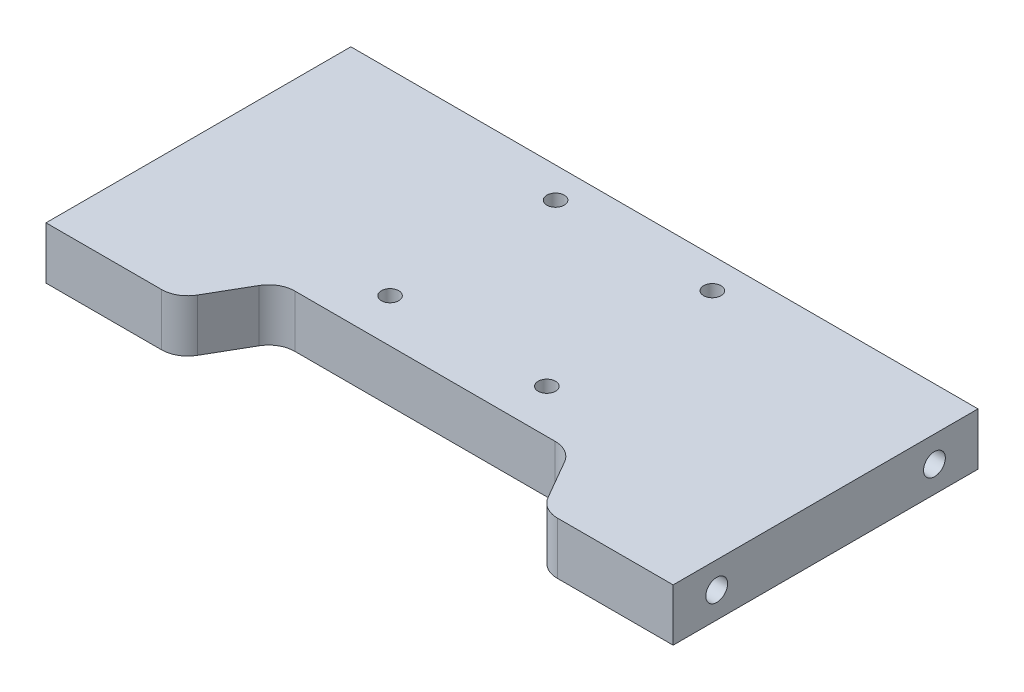
ISO-10303-21;
HEADER;
FILE_DESCRIPTION(('STEP AP214'),'2;1');
FILE_NAME('part.step','',(''),(''),'','','');
FILE_SCHEMA(('AUTOMOTIVE_DESIGN { 1 0 10303 214 1 1 1 1 }'));
ENDSEC;
DATA;
#1=APPLICATION_CONTEXT('core data for automotive mechanical design processes');
#2=APPLICATION_PROTOCOL_DEFINITION('international standard','automotive_design',2000,#1);
#3=PRODUCT_CONTEXT('',#1,'mechanical');
#4=PRODUCT('Part','Part','',(#3));
#5=PRODUCT_RELATED_PRODUCT_CATEGORY('part','',(#4));
#6=PRODUCT_DEFINITION_FORMATION('','',#4);
#7=PRODUCT_DEFINITION_CONTEXT('part definition',#1,'design');
#8=PRODUCT_DEFINITION('design','',#6,#7);
#9=PRODUCT_DEFINITION_SHAPE('','',#8);
#10=(LENGTH_UNIT() NAMED_UNIT(*) SI_UNIT(.MILLI.,.METRE.));
#11=(NAMED_UNIT(*) PLANE_ANGLE_UNIT() SI_UNIT($,.RADIAN.));
#12=(NAMED_UNIT(*) SI_UNIT($,.STERADIAN.) SOLID_ANGLE_UNIT());
#13=UNCERTAINTY_MEASURE_WITH_UNIT(LENGTH_MEASURE(1.E-05),#10,'distance_accuracy_value','');
#14=(GEOMETRIC_REPRESENTATION_CONTEXT(3) GLOBAL_UNCERTAINTY_ASSIGNED_CONTEXT((#13)) GLOBAL_UNIT_ASSIGNED_CONTEXT((#10,
#11,#12)) REPRESENTATION_CONTEXT('',''));
#15=CARTESIAN_POINT('',(0.,0.,0.));
#16=DIRECTION('',(0.,0.,1.));
#17=DIRECTION('',(1.,0.,0.));
#18=AXIS2_PLACEMENT_3D('',#15,#16,#17);
#19=CARTESIAN_POINT('',(0.,6.,0.));
#20=DIRECTION('',(0.,0.,-1.));
#21=DIRECTION('',(-1.,0.,0.));
#22=AXIS2_PLACEMENT_3D('',#19,#20,#21);
#23=PLANE('',#22);
#24=DIRECTION('',(1.,0.,0.));
#25=VECTOR('',#24,1.);
#26=CARTESIAN_POINT('',(0.,0.,0.));
#27=LINE('',#26,#25);
#28=CARTESIAN_POINT('',(0.,0.,0.));
#29=VERTEX_POINT('',#28);
#30=CARTESIAN_POINT('',(13.2679491924311,0.,0.));
#31=VERTEX_POINT('',#30);
#32=EDGE_CURVE('E222',#29,#31,#27,.T.);
#33=ORIENTED_EDGE('',*,*,#32,.T.);
#34=DIRECTION('',(0.,1.,0.));
#35=VECTOR('',#34,1.);
#36=CARTESIAN_POINT('',(13.2679491924311,6.,0.));
#37=LINE('',#36,#35);
#38=CARTESIAN_POINT('',(13.2679491924311,6.,0.));
#39=VERTEX_POINT('',#38);
#40=EDGE_CURVE('E263',#31,#39,#37,.T.);
#41=ORIENTED_EDGE('',*,*,#40,.T.);
#42=DIRECTION('',(1.,0.,0.));
#43=VECTOR('',#42,1.);
#44=CARTESIAN_POINT('',(0.,6.,0.));
#45=LINE('',#44,#43);
#46=CARTESIAN_POINT('',(0.,6.,0.));
#47=VERTEX_POINT('',#46);
#48=EDGE_CURVE('E211',#47,#39,#45,.T.);
#49=ORIENTED_EDGE('',*,*,#48,.F.);
#50=DIRECTION('',(0.,-1.,0.));
#51=VECTOR('',#50,1.);
#52=CARTESIAN_POINT('',(0.,6.,0.));
#53=LINE('',#52,#51);
#54=EDGE_CURVE('E236',#47,#29,#53,.T.);
#55=ORIENTED_EDGE('',*,*,#54,.T.);
#56=EDGE_LOOP('',(#33,#41,#49,#55));
#57=FACE_BOUND('',#56,.T.);
#58=ADVANCED_FACE('F33',(#57),#23,.F.);
#59=CARTESIAN_POINT('',(0.,6.,0.));
#60=DIRECTION('',(1.,0.,0.));
#61=DIRECTION('',(0.,0.,-1.));
#62=AXIS2_PLACEMENT_3D('',#59,#60,#61);
#63=PLANE('',#62);
#64=CARTESIAN_POINT('',(0.,3.,-30.));
#65=DIRECTION('',(-1.,0.,0.));
#66=DIRECTION('',(0.,0.,1.));
#67=AXIS2_PLACEMENT_3D('',#64,#65,#66);
#68=CIRCLE('',#67,1.25);
#69=CARTESIAN_POINT('',(0.,3.,-28.75));
#70=VERTEX_POINT('',#69);
#71=EDGE_CURVE('E154',#70,#70,#68,.T.);
#72=ORIENTED_EDGE('',*,*,#71,.F.);
#73=EDGE_LOOP('',(#72));
#74=FACE_BOUND('',#73,.T.);
#75=CARTESIAN_POINT('',(0.,3.,-5.));
#76=DIRECTION('',(-1.,0.,0.));
#77=DIRECTION('',(0.,0.,1.));
#78=AXIS2_PLACEMENT_3D('',#75,#76,#77);
#79=CIRCLE('',#78,1.25);
#80=CARTESIAN_POINT('',(0.,3.,-3.75));
#81=VERTEX_POINT('',#80);
#82=EDGE_CURVE('E160',#81,#81,#79,.T.);
#83=ORIENTED_EDGE('',*,*,#82,.F.);
#84=EDGE_LOOP('',(#83));
#85=FACE_BOUND('',#84,.T.);
#86=DIRECTION('',(0.,0.,1.));
#87=VECTOR('',#86,1.);
#88=CARTESIAN_POINT('',(0.,0.,0.));
#89=LINE('',#88,#87);
#90=CARTESIAN_POINT('',(0.,0.,-35.));
#91=VERTEX_POINT('',#90);
#92=EDGE_CURVE('E205',#91,#29,#89,.T.);
#93=ORIENTED_EDGE('',*,*,#92,.T.);
#94=ORIENTED_EDGE('',*,*,#54,.F.);
#95=DIRECTION('',(0.,0.,1.));
#96=VECTOR('',#95,1.);
#97=CARTESIAN_POINT('',(0.,6.,0.));
#98=LINE('',#97,#96);
#99=CARTESIAN_POINT('',(0.,6.,-35.));
#100=VERTEX_POINT('',#99);
#101=EDGE_CURVE('E206',#100,#47,#98,.T.);
#102=ORIENTED_EDGE('',*,*,#101,.F.);
#103=DIRECTION('',(0.,-1.,0.));
#104=VECTOR('',#103,1.);
#105=CARTESIAN_POINT('',(0.,6.,-35.));
#106=LINE('',#105,#104);
#107=EDGE_CURVE('E218',#100,#91,#106,.T.);
#108=ORIENTED_EDGE('',*,*,#107,.T.);
#109=EDGE_LOOP('',(#93,#94,#102,#108));
#110=FACE_BOUND('',#109,.T.);
#111=ADVANCED_FACE('F293',(#74,#85,#110),#63,.F.);
#112=CARTESIAN_POINT('',(58.7320508075689,6.,0.));
#113=VERTEX_POINT('',#112);
#114=CARTESIAN_POINT('',(72.,6.,0.));
#115=VERTEX_POINT('',#114);
#116=EDGE_CURVE('E209',#113,#115,#45,.T.);
#117=ORIENTED_EDGE('',*,*,#116,.F.);
#118=DIRECTION('',(0.,1.,0.));
#119=VECTOR('',#118,1.);
#120=CARTESIAN_POINT('',(58.7320508075689,6.,0.));
#121=LINE('',#120,#119);
#122=CARTESIAN_POINT('',(58.7320508075689,0.,0.));
#123=VERTEX_POINT('',#122);
#124=EDGE_CURVE('E248',#113,#123,#121,.F.);
#125=ORIENTED_EDGE('',*,*,#124,.T.);
#126=CARTESIAN_POINT('',(72.,0.,0.));
#127=VERTEX_POINT('',#126);
#128=EDGE_CURVE('E221',#123,#127,#27,.T.);
#129=ORIENTED_EDGE('',*,*,#128,.T.);
#130=DIRECTION('',(0.,-1.,0.));
#131=VECTOR('',#130,1.);
#132=CARTESIAN_POINT('',(72.,6.,0.));
#133=LINE('',#132,#131);
#134=EDGE_CURVE('E233',#115,#127,#133,.T.);
#135=ORIENTED_EDGE('',*,*,#134,.F.);
#136=EDGE_LOOP('',(#117,#125,#129,#135));
#137=FACE_BOUND('',#136,.T.);
#138=ADVANCED_FACE('F307',(#137),#23,.F.);
#139=CARTESIAN_POINT('',(72.,6.,0.));
#140=DIRECTION('',(-1.,0.,0.));
#141=DIRECTION('',(0.,0.,1.));
#142=AXIS2_PLACEMENT_3D('',#139,#140,#141);
#143=PLANE('',#142);
#144=CARTESIAN_POINT('',(72.,3.,-5.));
#145=DIRECTION('',(1.,0.,0.));
#146=DIRECTION('',(0.,0.,-1.));
#147=AXIS2_PLACEMENT_3D('',#144,#145,#146);
#148=CIRCLE('',#147,1.25);
#149=CARTESIAN_POINT('',(72.,3.,-6.25));
#150=VERTEX_POINT('',#149);
#151=EDGE_CURVE('E144',#150,#150,#148,.T.);
#152=ORIENTED_EDGE('',*,*,#151,.F.);
#153=EDGE_LOOP('',(#152));
#154=FACE_BOUND('',#153,.T.);
#155=CARTESIAN_POINT('',(72.,3.,-30.));
#156=DIRECTION('',(1.,0.,0.));
#157=DIRECTION('',(0.,0.,-1.));
#158=AXIS2_PLACEMENT_3D('',#155,#156,#157);
#159=CIRCLE('',#158,1.25);
#160=CARTESIAN_POINT('',(72.,3.,-31.25));
#161=VERTEX_POINT('',#160);
#162=EDGE_CURVE('E143',#161,#161,#159,.T.);
#163=ORIENTED_EDGE('',*,*,#162,.F.);
#164=EDGE_LOOP('',(#163));
#165=FACE_BOUND('',#164,.T.);
#166=DIRECTION('',(0.,0.,-1.));
#167=VECTOR('',#166,1.);
#168=CARTESIAN_POINT('',(72.,0.,0.));
#169=LINE('',#168,#167);
#170=CARTESIAN_POINT('',(72.,0.,-35.));
#171=VERTEX_POINT('',#170);
#172=EDGE_CURVE('E225',#127,#171,#169,.T.);
#173=ORIENTED_EDGE('',*,*,#172,.T.);
#174=DIRECTION('',(0.,-1.,0.));
#175=VECTOR('',#174,1.);
#176=CARTESIAN_POINT('',(72.,6.,-35.));
#177=LINE('',#176,#175);
#178=CARTESIAN_POINT('',(72.,6.,-35.));
#179=VERTEX_POINT('',#178);
#180=EDGE_CURVE('E230',#179,#171,#177,.T.);
#181=ORIENTED_EDGE('',*,*,#180,.F.);
#182=DIRECTION('',(0.,0.,-1.));
#183=VECTOR('',#182,1.);
#184=CARTESIAN_POINT('',(72.,6.,0.));
#185=LINE('',#184,#183);
#186=EDGE_CURVE('E214',#115,#179,#185,.T.);
#187=ORIENTED_EDGE('',*,*,#186,.F.);
#188=ORIENTED_EDGE('',*,*,#134,.T.);
#189=EDGE_LOOP('',(#173,#181,#187,#188));
#190=FACE_BOUND('',#189,.T.);
#191=ADVANCED_FACE('F303',(#154,#165,#190),#143,.F.);
#192=CARTESIAN_POINT('',(0.,6.,-35.));
#193=DIRECTION('',(0.,0.,1.));
#194=DIRECTION('',(1.,0.,0.));
#195=AXIS2_PLACEMENT_3D('',#192,#193,#194);
#196=PLANE('',#195);
#197=DIRECTION('',(-1.,0.,0.));
#198=VECTOR('',#197,1.);
#199=CARTESIAN_POINT('',(0.,0.,-35.));
#200=LINE('',#199,#198);
#201=EDGE_CURVE('E210',#171,#91,#200,.T.);
#202=ORIENTED_EDGE('',*,*,#201,.T.);
#203=ORIENTED_EDGE('',*,*,#107,.F.);
#204=DIRECTION('',(-1.,0.,0.));
#205=VECTOR('',#204,1.);
#206=CARTESIAN_POINT('',(0.,6.,-35.));
#207=LINE('',#206,#205);
#208=EDGE_CURVE('E216',#179,#100,#207,.T.);
#209=ORIENTED_EDGE('',*,*,#208,.F.);
#210=ORIENTED_EDGE('',*,*,#180,.T.);
#211=EDGE_LOOP('',(#202,#203,#209,#210));
#212=FACE_BOUND('',#211,.T.);
#213=ADVANCED_FACE('F298',(#212),#196,.F.);
#214=CARTESIAN_POINT('',(0.,6.,0.));
#215=DIRECTION('',(0.,-1.,0.));
#216=DIRECTION('',(0.,0.,-1.));
#217=AXIS2_PLACEMENT_3D('',#214,#215,#216);
#218=PLANE('',#217);
#219=CARTESIAN_POINT('',(27.,6.,-31.5));
#220=DIRECTION('',(0.,1.,0.));
#221=DIRECTION('',(0.,0.,1.));
#222=AXIS2_PLACEMENT_3D('',#219,#220,#221);
#223=CIRCLE('',#222,1.);
#224=CARTESIAN_POINT('',(27.,6.,-30.5));
#225=VERTEX_POINT('',#224);
#226=EDGE_CURVE('E167',#225,#225,#223,.T.);
#227=ORIENTED_EDGE('',*,*,#226,.F.);
#228=EDGE_LOOP('',(#227));
#229=FACE_BOUND('',#228,.T.);
#230=CARTESIAN_POINT('',(45.,6.,-31.5));
#231=DIRECTION('',(0.,1.,0.));
#232=DIRECTION('',(0.,0.,1.));
#233=AXIS2_PLACEMENT_3D('',#230,#231,#232);
#234=CIRCLE('',#233,0.999999999999998);
#235=CARTESIAN_POINT('',(45.,6.,-30.5));
#236=VERTEX_POINT('',#235);
#237=EDGE_CURVE('E173',#236,#236,#234,.T.);
#238=ORIENTED_EDGE('',*,*,#237,.F.);
#239=EDGE_LOOP('',(#238));
#240=FACE_BOUND('',#239,.T.);
#241=CARTESIAN_POINT('',(45.,6.,-12.5));
#242=DIRECTION('',(0.,1.,0.));
#243=DIRECTION('',(0.,0.,1.));
#244=AXIS2_PLACEMENT_3D('',#241,#242,#243);
#245=CIRCLE('',#244,0.999999999999998);
#246=CARTESIAN_POINT('',(45.,6.,-11.5));
#247=VERTEX_POINT('',#246);
#248=EDGE_CURVE('E179',#247,#247,#245,.T.);
#249=ORIENTED_EDGE('',*,*,#248,.F.);
#250=EDGE_LOOP('',(#249));
#251=FACE_BOUND('',#250,.T.);
#252=CARTESIAN_POINT('',(27.,6.,-12.5));
#253=DIRECTION('',(0.,1.,0.));
#254=DIRECTION('',(0.,0.,1.));
#255=AXIS2_PLACEMENT_3D('',#252,#253,#254);
#256=CIRCLE('',#255,1.);
#257=CARTESIAN_POINT('',(27.,6.,-11.5));
#258=VERTEX_POINT('',#257);
#259=EDGE_CURVE('E185',#258,#258,#256,.T.);
#260=ORIENTED_EDGE('',*,*,#259,.F.);
#261=EDGE_LOOP('',(#260));
#262=FACE_BOUND('',#261,.T.);
#263=DIRECTION('',(-0.499999999999998,0.,-0.86602540378444));
#264=VECTOR('',#263,1.);
#265=CARTESIAN_POINT('',(52.6698729810778,6.,-7.5));
#266=LINE('',#265,#264);
#267=CARTESIAN_POINT('',(56.1339745962156,6.,-1.50000000000001));
#268=VERTEX_POINT('',#267);
#269=CARTESIAN_POINT('',(53.5358983848623,6.,-5.99999999999999));
#270=VERTEX_POINT('',#269);
#271=EDGE_CURVE('E200',#268,#270,#266,.T.);
#272=ORIENTED_EDGE('',*,*,#271,.F.);
#273=CARTESIAN_POINT('',(58.7320508075689,6.,-3.));
#274=DIRECTION('',(0.,-1.,0.));
#275=DIRECTION('',(0.,0.,-1.));
#276=AXIS2_PLACEMENT_3D('',#273,#274,#275);
#277=CIRCLE('',#276,3.);
#278=EDGE_CURVE('E246',#268,#113,#277,.F.);
#279=ORIENTED_EDGE('',*,*,#278,.T.);
#280=ORIENTED_EDGE('',*,*,#116,.T.);
#281=ORIENTED_EDGE('',*,*,#186,.T.);
#282=ORIENTED_EDGE('',*,*,#208,.T.);
#283=ORIENTED_EDGE('',*,*,#101,.T.);
#284=ORIENTED_EDGE('',*,*,#48,.T.);
#285=CARTESIAN_POINT('',(13.2679491924311,6.,-3.));
#286=DIRECTION('',(0.,-1.,0.));
#287=DIRECTION('',(0.,0.,-1.));
#288=AXIS2_PLACEMENT_3D('',#285,#286,#287);
#289=CIRCLE('',#288,3.);
#290=CARTESIAN_POINT('',(15.8660254037844,6.,-1.50000000000001));
#291=VERTEX_POINT('',#290);
#292=EDGE_CURVE('E244',#39,#291,#289,.F.);
#293=ORIENTED_EDGE('',*,*,#292,.T.);
#294=DIRECTION('',(-0.499999999999998,0.,0.86602540378444));
#295=VECTOR('',#294,1.);
#296=CARTESIAN_POINT('',(15.,6.,0.));
#297=LINE('',#296,#295);
#298=CARTESIAN_POINT('',(18.4641016151377,6.,-5.99999999999999));
#299=VERTEX_POINT('',#298);
#300=EDGE_CURVE('E197',#299,#291,#297,.T.);
#301=ORIENTED_EDGE('',*,*,#300,.F.);
#302=CARTESIAN_POINT('',(21.0621778264911,6.,-4.5));
#303=DIRECTION('',(0.,-1.,0.));
#304=DIRECTION('',(0.,0.,-1.));
#305=AXIS2_PLACEMENT_3D('',#302,#303,#304);
#306=CIRCLE('',#305,3.);
#307=CARTESIAN_POINT('',(21.0621778264911,6.,-7.5));
#308=VERTEX_POINT('',#307);
#309=EDGE_CURVE('E41',#299,#308,#306,.T.);
#310=ORIENTED_EDGE('',*,*,#309,.T.);
#311=DIRECTION('',(-1.,0.,0.));
#312=VECTOR('',#311,1.);
#313=CARTESIAN_POINT('',(19.3301270189222,6.,-7.5));
#314=LINE('',#313,#312);
#315=CARTESIAN_POINT('',(50.9378221735089,6.,-7.5));
#316=VERTEX_POINT('',#315);
#317=EDGE_CURVE('E203',#316,#308,#314,.T.);
#318=ORIENTED_EDGE('',*,*,#317,.F.);
#319=CARTESIAN_POINT('',(50.9378221735089,6.,-4.5));
#320=DIRECTION('',(0.,-1.,0.));
#321=DIRECTION('',(0.,0.,-1.));
#322=AXIS2_PLACEMENT_3D('',#319,#320,#321);
#323=CIRCLE('',#322,3.);
#324=EDGE_CURVE('E266',#316,#270,#323,.T.);
#325=ORIENTED_EDGE('',*,*,#324,.T.);
#326=EDGE_LOOP('',(#272,#279,#280,#281,#282,#283,#284,#293,#301,#310,#318,#325));
#327=FACE_BOUND('',#326,.T.);
#328=ADVANCED_FACE('F272',(#229,#240,#251,#262,#327),#218,.F.);
#329=CARTESIAN_POINT('',(0.,0.,0.));
#330=DIRECTION('',(0.,-1.,0.));
#331=DIRECTION('',(0.,0.,-1.));
#332=AXIS2_PLACEMENT_3D('',#329,#330,#331);
#333=PLANE('',#332);
#334=CARTESIAN_POINT('',(27.,0.,-31.5));
#335=DIRECTION('',(0.,-1.,0.));
#336=DIRECTION('',(0.,0.,-1.));
#337=AXIS2_PLACEMENT_3D('',#334,#335,#336);
#338=CIRCLE('',#337,1.);
#339=CARTESIAN_POINT('',(27.,0.,-32.5));
#340=VERTEX_POINT('',#339);
#341=EDGE_CURVE('E166',#340,#340,#338,.F.);
#342=ORIENTED_EDGE('',*,*,#341,.T.);
#343=EDGE_LOOP('',(#342));
#344=FACE_BOUND('',#343,.T.);
#345=CARTESIAN_POINT('',(45.,0.,-31.5));
#346=DIRECTION('',(0.,-1.,0.));
#347=DIRECTION('',(0.,0.,-1.));
#348=AXIS2_PLACEMENT_3D('',#345,#346,#347);
#349=CIRCLE('',#348,0.999999999999998);
#350=CARTESIAN_POINT('',(45.,0.,-32.5));
#351=VERTEX_POINT('',#350);
#352=EDGE_CURVE('E170',#351,#351,#349,.F.);
#353=ORIENTED_EDGE('',*,*,#352,.T.);
#354=EDGE_LOOP('',(#353));
#355=FACE_BOUND('',#354,.T.);
#356=CARTESIAN_POINT('',(45.,0.,-12.5));
#357=DIRECTION('',(0.,-1.,0.));
#358=DIRECTION('',(0.,0.,-1.));
#359=AXIS2_PLACEMENT_3D('',#356,#357,#358);
#360=CIRCLE('',#359,0.999999999999998);
#361=CARTESIAN_POINT('',(45.,0.,-13.5));
#362=VERTEX_POINT('',#361);
#363=EDGE_CURVE('E176',#362,#362,#360,.F.);
#364=ORIENTED_EDGE('',*,*,#363,.T.);
#365=EDGE_LOOP('',(#364));
#366=FACE_BOUND('',#365,.T.);
#367=CARTESIAN_POINT('',(27.,0.,-12.5));
#368=DIRECTION('',(0.,-1.,0.));
#369=DIRECTION('',(0.,0.,-1.));
#370=AXIS2_PLACEMENT_3D('',#367,#368,#369);
#371=CIRCLE('',#370,1.);
#372=CARTESIAN_POINT('',(27.,0.,-13.5));
#373=VERTEX_POINT('',#372);
#374=EDGE_CURVE('E182',#373,#373,#371,.F.);
#375=ORIENTED_EDGE('',*,*,#374,.T.);
#376=EDGE_LOOP('',(#375));
#377=FACE_BOUND('',#376,.T.);
#378=ORIENTED_EDGE('',*,*,#128,.F.);
#379=CARTESIAN_POINT('',(58.7320508075689,0.,-3.));
#380=DIRECTION('',(0.,-1.,0.));
#381=DIRECTION('',(0.,0.,-1.));
#382=AXIS2_PLACEMENT_3D('',#379,#380,#381);
#383=CIRCLE('',#382,3.);
#384=CARTESIAN_POINT('',(56.1339745962156,0.,-1.5));
#385=VERTEX_POINT('',#384);
#386=EDGE_CURVE('E252',#123,#385,#383,.T.);
#387=ORIENTED_EDGE('',*,*,#386,.T.);
#388=DIRECTION('',(-0.499999999999998,0.,-0.86602540378444));
#389=VECTOR('',#388,1.);
#390=CARTESIAN_POINT('',(52.6698729810778,0.,-7.5));
#391=LINE('',#390,#389);
#392=CARTESIAN_POINT('',(53.5358983848623,0.,-5.99999999999999));
#393=VERTEX_POINT('',#392);
#394=EDGE_CURVE('E188',#385,#393,#391,.T.);
#395=ORIENTED_EDGE('',*,*,#394,.T.);
#396=CARTESIAN_POINT('',(50.9378221735089,0.,-4.5));
#397=DIRECTION('',(0.,-1.,0.));
#398=DIRECTION('',(0.,0.,-1.));
#399=AXIS2_PLACEMENT_3D('',#396,#397,#398);
#400=CIRCLE('',#399,3.);
#401=CARTESIAN_POINT('',(50.9378221735089,0.,-7.5));
#402=VERTEX_POINT('',#401);
#403=EDGE_CURVE('E55',#393,#402,#400,.F.);
#404=ORIENTED_EDGE('',*,*,#403,.T.);
#405=DIRECTION('',(-1.,0.,0.));
#406=VECTOR('',#405,1.);
#407=CARTESIAN_POINT('',(19.3301270189222,0.,-7.5));
#408=LINE('',#407,#406);
#409=CARTESIAN_POINT('',(21.0621778264911,0.,-7.5));
#410=VERTEX_POINT('',#409);
#411=EDGE_CURVE('E192',#402,#410,#408,.T.);
#412=ORIENTED_EDGE('',*,*,#411,.T.);
#413=CARTESIAN_POINT('',(21.0621778264911,0.,-4.5));
#414=DIRECTION('',(0.,-1.,0.));
#415=DIRECTION('',(0.,0.,-1.));
#416=AXIS2_PLACEMENT_3D('',#413,#414,#415);
#417=CIRCLE('',#416,3.);
#418=CARTESIAN_POINT('',(18.4641016151377,0.,-6.));
#419=VERTEX_POINT('',#418);
#420=EDGE_CURVE('E11',#410,#419,#417,.F.);
#421=ORIENTED_EDGE('',*,*,#420,.T.);
#422=DIRECTION('',(-0.499999999999998,0.,0.86602540378444));
#423=VECTOR('',#422,1.);
#424=CARTESIAN_POINT('',(15.,0.,0.));
#425=LINE('',#424,#423);
#426=CARTESIAN_POINT('',(15.8660254037844,0.,-1.50000000000001));
#427=VERTEX_POINT('',#426);
#428=EDGE_CURVE('E194',#419,#427,#425,.T.);
#429=ORIENTED_EDGE('',*,*,#428,.T.);
#430=CARTESIAN_POINT('',(13.2679491924311,0.,-3.));
#431=DIRECTION('',(0.,-1.,0.));
#432=DIRECTION('',(0.,0.,-1.));
#433=AXIS2_PLACEMENT_3D('',#430,#431,#432);
#434=CIRCLE('',#433,3.);
#435=EDGE_CURVE('E250',#427,#31,#434,.T.);
#436=ORIENTED_EDGE('',*,*,#435,.T.);
#437=ORIENTED_EDGE('',*,*,#32,.F.);
#438=ORIENTED_EDGE('',*,*,#92,.F.);
#439=ORIENTED_EDGE('',*,*,#201,.F.);
#440=ORIENTED_EDGE('',*,*,#172,.F.);
#441=EDGE_LOOP('',(#378,#387,#395,#404,#412,#421,#429,#436,#437,#438,#439,#440));
#442=FACE_BOUND('',#441,.T.);
#443=ADVANCED_FACE('F281',(#344,#355,#366,#377,#442),#333,.T.);
#444=CARTESIAN_POINT('',(15.,-0.00100000000000013,0.));
#445=DIRECTION('',(-0.86602540378444,0.,-0.499999999999998));
#446=DIRECTION('',(-0.499999999999998,0.,0.86602540378444));
#447=AXIS2_PLACEMENT_3D('',#444,#445,#446);
#448=PLANE('',#447);
#449=ORIENTED_EDGE('',*,*,#428,.F.);
#450=DIRECTION('',(0.,1.,0.));
#451=VECTOR('',#450,1.);
#452=CARTESIAN_POINT('',(18.4641016151377,6.,-5.99999999999999));
#453=LINE('',#452,#451);
#454=EDGE_CURVE('E260',#419,#299,#453,.T.);
#455=ORIENTED_EDGE('',*,*,#454,.T.);
#456=ORIENTED_EDGE('',*,*,#300,.T.);
#457=DIRECTION('',(0.,1.,0.));
#458=VECTOR('',#457,1.);
#459=CARTESIAN_POINT('',(15.8660254037844,-0.00100000000000013,-1.50000000000001));
#460=LINE('',#459,#458);
#461=EDGE_CURVE('E258',#291,#427,#460,.F.);
#462=ORIENTED_EDGE('',*,*,#461,.T.);
#463=EDGE_LOOP('',(#449,#455,#456,#462));
#464=FACE_BOUND('',#463,.T.);
#465=ADVANCED_FACE('F284',(#464),#448,.F.);
#466=CARTESIAN_POINT('',(19.3301270189222,-0.00100000000000013,-7.5));
#467=DIRECTION('',(0.,0.,-1.));
#468=DIRECTION('',(-1.,0.,0.));
#469=AXIS2_PLACEMENT_3D('',#466,#467,#468);
#470=PLANE('',#469);
#471=ORIENTED_EDGE('',*,*,#411,.F.);
#472=DIRECTION('',(0.,1.,0.));
#473=VECTOR('',#472,1.);
#474=CARTESIAN_POINT('',(50.9378221735089,6.,-7.5));
#475=LINE('',#474,#473);
#476=EDGE_CURVE('E255',#402,#316,#475,.T.);
#477=ORIENTED_EDGE('',*,*,#476,.T.);
#478=ORIENTED_EDGE('',*,*,#317,.T.);
#479=DIRECTION('',(0.,1.,0.));
#480=VECTOR('',#479,1.);
#481=CARTESIAN_POINT('',(21.0621778264911,0.,-7.5));
#482=LINE('',#481,#480);
#483=EDGE_CURVE('E48',#308,#410,#482,.F.);
#484=ORIENTED_EDGE('',*,*,#483,.T.);
#485=EDGE_LOOP('',(#471,#477,#478,#484));
#486=FACE_BOUND('',#485,.T.);
#487=ADVANCED_FACE('F275',(#486),#470,.F.);
#488=CARTESIAN_POINT('',(52.6698729810778,-0.00100000000000013,-7.5));
#489=DIRECTION('',(0.86602540378444,0.,-0.499999999999998));
#490=DIRECTION('',(-0.499999999999998,0.,-0.86602540378444));
#491=AXIS2_PLACEMENT_3D('',#488,#489,#490);
#492=PLANE('',#491);
#493=ORIENTED_EDGE('',*,*,#394,.F.);
#494=DIRECTION('',(0.,1.,0.));
#495=VECTOR('',#494,1.);
#496=CARTESIAN_POINT('',(56.1339745962156,-0.00100000000000013,-1.50000000000001));
#497=LINE('',#496,#495);
#498=EDGE_CURVE('E241',#385,#268,#497,.T.);
#499=ORIENTED_EDGE('',*,*,#498,.T.);
#500=ORIENTED_EDGE('',*,*,#271,.T.);
#501=DIRECTION('',(0.,1.,0.));
#502=VECTOR('',#501,1.);
#503=CARTESIAN_POINT('',(53.5358983848623,0.,-5.99999999999999));
#504=LINE('',#503,#502);
#505=EDGE_CURVE('E239',#270,#393,#504,.F.);
#506=ORIENTED_EDGE('',*,*,#505,.T.);
#507=EDGE_LOOP('',(#493,#499,#500,#506));
#508=FACE_BOUND('',#507,.T.);
#509=ADVANCED_FACE('F315',(#508),#492,.F.);
#510=CARTESIAN_POINT('',(27.,-0.00100000000000013,-12.5));
#511=DIRECTION('',(0.,1.,0.));
#512=DIRECTION('',(0.,0.,1.));
#513=AXIS2_PLACEMENT_3D('',#510,#511,#512);
#514=CYLINDRICAL_SURFACE('',#513,1.);
#515=ORIENTED_EDGE('',*,*,#374,.F.);
#516=EDGE_LOOP('',(#515));
#517=FACE_BOUND('',#516,.T.);
#518=ORIENTED_EDGE('',*,*,#259,.T.);
#519=EDGE_LOOP('',(#518));
#520=FACE_BOUND('',#519,.T.);
#521=ADVANCED_FACE('F357',(#517,#520),#514,.F.);
#522=CARTESIAN_POINT('',(45.,-0.00100000000000013,-12.5));
#523=DIRECTION('',(0.,1.,0.));
#524=DIRECTION('',(0.,0.,1.));
#525=AXIS2_PLACEMENT_3D('',#522,#523,#524);
#526=CYLINDRICAL_SURFACE('',#525,0.999999999999998);
#527=ORIENTED_EDGE('',*,*,#363,.F.);
#528=EDGE_LOOP('',(#527));
#529=FACE_BOUND('',#528,.T.);
#530=ORIENTED_EDGE('',*,*,#248,.T.);
#531=EDGE_LOOP('',(#530));
#532=FACE_BOUND('',#531,.T.);
#533=ADVANCED_FACE('F362',(#529,#532),#526,.F.);
#534=CARTESIAN_POINT('',(45.,-0.00100000000000013,-31.5));
#535=DIRECTION('',(0.,1.,0.));
#536=DIRECTION('',(0.,0.,1.));
#537=AXIS2_PLACEMENT_3D('',#534,#535,#536);
#538=CYLINDRICAL_SURFACE('',#537,0.999999999999998);
#539=ORIENTED_EDGE('',*,*,#352,.F.);
#540=EDGE_LOOP('',(#539));
#541=FACE_BOUND('',#540,.T.);
#542=ORIENTED_EDGE('',*,*,#237,.T.);
#543=EDGE_LOOP('',(#542));
#544=FACE_BOUND('',#543,.T.);
#545=ADVANCED_FACE('F366',(#541,#544),#538,.F.);
#546=CARTESIAN_POINT('',(27.,-0.00100000000000013,-31.5));
#547=DIRECTION('',(0.,1.,0.));
#548=DIRECTION('',(0.,0.,1.));
#549=AXIS2_PLACEMENT_3D('',#546,#547,#548);
#550=CYLINDRICAL_SURFACE('',#549,1.);
#551=ORIENTED_EDGE('',*,*,#341,.F.);
#552=EDGE_LOOP('',(#551));
#553=FACE_BOUND('',#552,.T.);
#554=ORIENTED_EDGE('',*,*,#226,.T.);
#555=EDGE_LOOP('',(#554));
#556=FACE_BOUND('',#555,.T.);
#557=ADVANCED_FACE('F325',(#553,#556),#550,.F.);
#558=CARTESIAN_POINT('',(58.7320508075689,-0.00100000000000013,-3.));
#559=DIRECTION('',(0.,1.,0.));
#560=DIRECTION('',(0.,0.,1.));
#561=AXIS2_PLACEMENT_3D('',#558,#559,#560);
#562=CYLINDRICAL_SURFACE('',#561,3.);
#563=ORIENTED_EDGE('',*,*,#386,.F.);
#564=ORIENTED_EDGE('',*,*,#124,.F.);
#565=ORIENTED_EDGE('',*,*,#278,.F.);
#566=ORIENTED_EDGE('',*,*,#498,.F.);
#567=EDGE_LOOP('',(#563,#564,#565,#566));
#568=FACE_BOUND('',#567,.T.);
#569=ADVANCED_FACE('F313',(#568),#562,.T.);
#570=CARTESIAN_POINT('',(50.9378221735089,-0.00100000000000013,-4.5));
#571=DIRECTION('',(0.,-1.,0.));
#572=DIRECTION('',(0.,0.,-1.));
#573=AXIS2_PLACEMENT_3D('',#570,#571,#572);
#574=CYLINDRICAL_SURFACE('',#573,3.);
#575=ORIENTED_EDGE('',*,*,#403,.F.);
#576=ORIENTED_EDGE('',*,*,#505,.F.);
#577=ORIENTED_EDGE('',*,*,#324,.F.);
#578=ORIENTED_EDGE('',*,*,#476,.F.);
#579=EDGE_LOOP('',(#575,#576,#577,#578));
#580=FACE_BOUND('',#579,.T.);
#581=ADVANCED_FACE('F318',(#580),#574,.F.);
#582=CARTESIAN_POINT('',(21.0621778264911,-0.00100000000000013,-4.5));
#583=DIRECTION('',(0.,-1.,0.));
#584=DIRECTION('',(0.,0.,-1.));
#585=AXIS2_PLACEMENT_3D('',#582,#583,#584);
#586=CYLINDRICAL_SURFACE('',#585,3.);
#587=ORIENTED_EDGE('',*,*,#420,.F.);
#588=ORIENTED_EDGE('',*,*,#483,.F.);
#589=ORIENTED_EDGE('',*,*,#309,.F.);
#590=ORIENTED_EDGE('',*,*,#454,.F.);
#591=EDGE_LOOP('',(#587,#588,#589,#590));
#592=FACE_BOUND('',#591,.T.);
#593=ADVANCED_FACE('F278',(#592),#586,.F.);
#594=CARTESIAN_POINT('',(13.2679491924311,6.,-3.));
#595=DIRECTION('',(0.,1.,0.));
#596=DIRECTION('',(0.,0.,1.));
#597=AXIS2_PLACEMENT_3D('',#594,#595,#596);
#598=CYLINDRICAL_SURFACE('',#597,3.);
#599=ORIENTED_EDGE('',*,*,#435,.F.);
#600=ORIENTED_EDGE('',*,*,#461,.F.);
#601=ORIENTED_EDGE('',*,*,#292,.F.);
#602=ORIENTED_EDGE('',*,*,#40,.F.);
#603=EDGE_LOOP('',(#599,#600,#601,#602));
#604=FACE_BOUND('',#603,.T.);
#605=ADVANCED_FACE('F35',(#604),#598,.T.);
#606=CARTESIAN_POINT('',(10.,3.,-5.));
#607=DIRECTION('',(-1.,0.,0.));
#608=DIRECTION('',(0.,0.,1.));
#609=AXIS2_PLACEMENT_3D('',#606,#607,#608);
#610=CONICAL_SURFACE('',#609,1.25,1.02974425867665);
#611=CARTESIAN_POINT('',(10.7510757737845,3.,-5.));
#612=VERTEX_POINT('',#611);
#613=VERTEX_LOOP('',#612);
#614=FACE_BOUND('',#613,.T.);
#615=CARTESIAN_POINT('',(10.,3.,-5.));
#616=DIRECTION('',(-1.,0.,0.));
#617=DIRECTION('',(0.,0.,1.));
#618=AXIS2_PLACEMENT_3D('',#615,#616,#617);
#619=CIRCLE('',#618,1.25);
#620=CARTESIAN_POINT('',(10.,3.,-3.75));
#621=VERTEX_POINT('',#620);
#622=EDGE_CURVE('E163',#621,#621,#619,.T.);
#623=ORIENTED_EDGE('',*,*,#622,.T.);
#624=EDGE_LOOP('',(#623));
#625=FACE_BOUND('',#624,.T.);
#626=ADVANCED_FACE('F374',(#614,#625),#610,.F.);
#627=CARTESIAN_POINT('',(0.,3.,-5.));
#628=DIRECTION('',(-1.,0.,0.));
#629=DIRECTION('',(0.,0.,1.));
#630=AXIS2_PLACEMENT_3D('',#627,#628,#629);
#631=CYLINDRICAL_SURFACE('',#630,1.25);
#632=ORIENTED_EDGE('',*,*,#622,.F.);
#633=EDGE_LOOP('',(#632));
#634=FACE_BOUND('',#633,.T.);
#635=ORIENTED_EDGE('',*,*,#82,.T.);
#636=EDGE_LOOP('',(#635));
#637=FACE_BOUND('',#636,.T.);
#638=ADVANCED_FACE('F377',(#634,#637),#631,.F.);
#639=CARTESIAN_POINT('',(10.,3.,-30.));
#640=DIRECTION('',(-1.,0.,0.));
#641=DIRECTION('',(0.,0.,1.));
#642=AXIS2_PLACEMENT_3D('',#639,#640,#641);
#643=CONICAL_SURFACE('',#642,1.25,1.02974425867665);
#644=CARTESIAN_POINT('',(10.7510757737845,3.,-30.));
#645=VERTEX_POINT('',#644);
#646=VERTEX_LOOP('',#645);
#647=FACE_BOUND('',#646,.T.);
#648=CARTESIAN_POINT('',(10.,3.,-30.));
#649=DIRECTION('',(-1.,0.,0.));
#650=DIRECTION('',(0.,0.,1.));
#651=AXIS2_PLACEMENT_3D('',#648,#649,#650);
#652=CIRCLE('',#651,1.25);
#653=CARTESIAN_POINT('',(10.,3.,-28.75));
#654=VERTEX_POINT('',#653);
#655=EDGE_CURVE('E157',#654,#654,#652,.T.);
#656=ORIENTED_EDGE('',*,*,#655,.T.);
#657=EDGE_LOOP('',(#656));
#658=FACE_BOUND('',#657,.T.);
#659=ADVANCED_FACE('F381',(#647,#658),#643,.F.);
#660=CARTESIAN_POINT('',(0.,3.,-30.));
#661=DIRECTION('',(-1.,0.,0.));
#662=DIRECTION('',(0.,0.,1.));
#663=AXIS2_PLACEMENT_3D('',#660,#661,#662);
#664=CYLINDRICAL_SURFACE('',#663,1.25);
#665=ORIENTED_EDGE('',*,*,#655,.F.);
#666=EDGE_LOOP('',(#665));
#667=FACE_BOUND('',#666,.T.);
#668=ORIENTED_EDGE('',*,*,#71,.T.);
#669=EDGE_LOOP('',(#668));
#670=FACE_BOUND('',#669,.T.);
#671=ADVANCED_FACE('F385',(#667,#670),#664,.F.);
#672=CARTESIAN_POINT('',(62.,3.,-30.));
#673=DIRECTION('',(1.,0.,0.));
#674=DIRECTION('',(0.,0.,-1.));
#675=AXIS2_PLACEMENT_3D('',#672,#673,#674);
#676=CONICAL_SURFACE('',#675,1.25,1.02974425867665);
#677=CARTESIAN_POINT('',(61.2489242262155,3.,-30.));
#678=VERTEX_POINT('',#677);
#679=VERTEX_LOOP('',#678);
#680=FACE_BOUND('',#679,.T.);
#681=CARTESIAN_POINT('',(62.,3.,-30.));
#682=DIRECTION('',(1.,0.,0.));
#683=DIRECTION('',(0.,0.,-1.));
#684=AXIS2_PLACEMENT_3D('',#681,#682,#683);
#685=CIRCLE('',#684,1.25);
#686=CARTESIAN_POINT('',(62.,3.,-31.25));
#687=VERTEX_POINT('',#686);
#688=EDGE_CURVE('E147',#687,#687,#685,.T.);
#689=ORIENTED_EDGE('',*,*,#688,.T.);
#690=EDGE_LOOP('',(#689));
#691=FACE_BOUND('',#690,.T.);
#692=ADVANCED_FACE('F389',(#680,#691),#676,.F.);
#693=CARTESIAN_POINT('',(72.,3.,-30.));
#694=DIRECTION('',(1.,0.,0.));
#695=DIRECTION('',(0.,0.,-1.));
#696=AXIS2_PLACEMENT_3D('',#693,#694,#695);
#697=CYLINDRICAL_SURFACE('',#696,1.25);
#698=ORIENTED_EDGE('',*,*,#688,.F.);
#699=EDGE_LOOP('',(#698));
#700=FACE_BOUND('',#699,.T.);
#701=ORIENTED_EDGE('',*,*,#162,.T.);
#702=EDGE_LOOP('',(#701));
#703=FACE_BOUND('',#702,.T.);
#704=ADVANCED_FACE('F137',(#700,#703),#697,.F.);
#705=CARTESIAN_POINT('',(62.,3.,-5.));
#706=DIRECTION('',(1.,0.,0.));
#707=DIRECTION('',(0.,0.,-1.));
#708=AXIS2_PLACEMENT_3D('',#705,#706,#707);
#709=CONICAL_SURFACE('',#708,1.25,1.02974425867665);
#710=CARTESIAN_POINT('',(61.2489242262155,3.,-5.));
#711=VERTEX_POINT('',#710);
#712=VERTEX_LOOP('',#711);
#713=FACE_BOUND('',#712,.T.);
#714=CARTESIAN_POINT('',(62.,3.,-5.));
#715=DIRECTION('',(1.,0.,0.));
#716=DIRECTION('',(0.,0.,-1.));
#717=AXIS2_PLACEMENT_3D('',#714,#715,#716);
#718=CIRCLE('',#717,1.25);
#719=CARTESIAN_POINT('',(62.,3.,-6.25));
#720=VERTEX_POINT('',#719);
#721=EDGE_CURVE('E141',#720,#720,#718,.T.);
#722=ORIENTED_EDGE('',*,*,#721,.T.);
#723=EDGE_LOOP('',(#722));
#724=FACE_BOUND('',#723,.T.);
#725=ADVANCED_FACE('F133',(#713,#724),#709,.F.);
#726=CARTESIAN_POINT('',(72.,3.,-5.));
#727=DIRECTION('',(1.,0.,0.));
#728=DIRECTION('',(0.,0.,-1.));
#729=AXIS2_PLACEMENT_3D('',#726,#727,#728);
#730=CYLINDRICAL_SURFACE('',#729,1.25);
#731=ORIENTED_EDGE('',*,*,#721,.F.);
#732=EDGE_LOOP('',(#731));
#733=FACE_BOUND('',#732,.T.);
#734=ORIENTED_EDGE('',*,*,#151,.T.);
#735=EDGE_LOOP('',(#734));
#736=FACE_BOUND('',#735,.T.);
#737=ADVANCED_FACE('F136',(#733,#736),#730,.F.);
#738=CLOSED_SHELL('',(#58,#111,#138,#191,#213,#328,#443,#465,#487,#509,#521,#533,#545,#557,#569,
#581,#593,#605,#626,#638,#659,#671,#692,#704,#725,#737));
#739=MANIFOLD_SOLID_BREP('B2',#738);
#740=ADVANCED_BREP_SHAPE_REPRESENTATION('',(#18,#739),#14);
#741=SHAPE_DEFINITION_REPRESENTATION(#9,#740);
ENDSEC;
END-ISO-10303-21;
